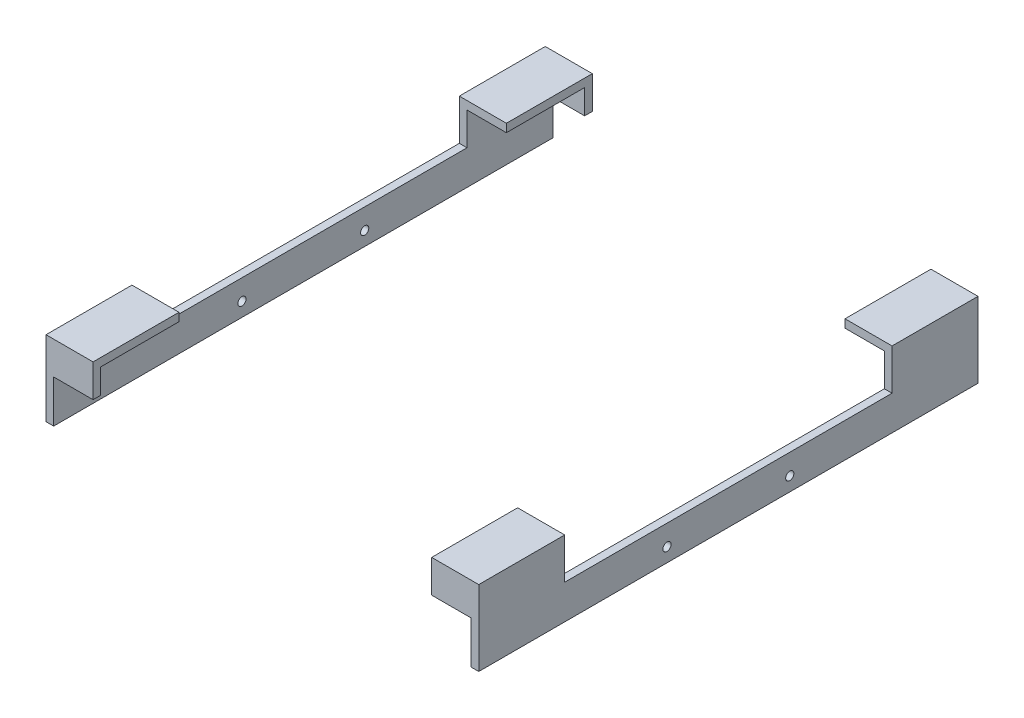
ISO-10303-21;
HEADER;
FILE_DESCRIPTION(('STEP AP214'),'2;1');
FILE_NAME('part.step','',(''),(''),'','','');
FILE_SCHEMA(('AUTOMOTIVE_DESIGN { 1 0 10303 214 1 1 1 1 }'));
ENDSEC;
DATA;
#1=APPLICATION_CONTEXT('core data for automotive mechanical design processes');
#2=APPLICATION_PROTOCOL_DEFINITION('international standard','automotive_design',2000,#1);
#3=PRODUCT_CONTEXT('',#1,'mechanical');
#4=PRODUCT('Part','Part','',(#3));
#5=PRODUCT_RELATED_PRODUCT_CATEGORY('part','',(#4));
#6=PRODUCT_DEFINITION_FORMATION('','',#4);
#7=PRODUCT_DEFINITION_CONTEXT('part definition',#1,'design');
#8=PRODUCT_DEFINITION('design','',#6,#7);
#9=PRODUCT_DEFINITION_SHAPE('','',#8);
#10=(LENGTH_UNIT() NAMED_UNIT(*) SI_UNIT(.MILLI.,.METRE.));
#11=(NAMED_UNIT(*) PLANE_ANGLE_UNIT() SI_UNIT($,.RADIAN.));
#12=(NAMED_UNIT(*) SI_UNIT($,.STERADIAN.) SOLID_ANGLE_UNIT());
#13=UNCERTAINTY_MEASURE_WITH_UNIT(LENGTH_MEASURE(1.E-05),#10,'distance_accuracy_value','');
#14=(GEOMETRIC_REPRESENTATION_CONTEXT(3) GLOBAL_UNCERTAINTY_ASSIGNED_CONTEXT((#13)) GLOBAL_UNIT_ASSIGNED_CONTEXT((#10,
#11,#12)) REPRESENTATION_CONTEXT('',''));
#15=CARTESIAN_POINT('',(0.,0.,0.));
#16=DIRECTION('',(0.,0.,1.));
#17=DIRECTION('',(1.,0.,0.));
#18=AXIS2_PLACEMENT_3D('',#15,#16,#17);
#19=CARTESIAN_POINT('',(105.0925,45.72,-154.94));
#20=DIRECTION('',(-1.,0.,0.));
#21=DIRECTION('',(0.,0.,1.));
#22=AXIS2_PLACEMENT_3D('',#19,#20,#21);
#23=PLANE('',#22);
#24=DIRECTION('',(0.,-1.,0.));
#25=VECTOR('',#24,1.);
#26=CARTESIAN_POINT('',(105.0925,50.8,101.6));
#27=LINE('',#26,#25);
#28=CARTESIAN_POINT('',(105.0925,50.8,101.6));
#29=VERTEX_POINT('',#28);
#30=CARTESIAN_POINT('',(105.0925,45.72,101.6));
#31=VERTEX_POINT('',#30);
#32=EDGE_CURVE('E295',#29,#31,#27,.T.);
#33=ORIENTED_EDGE('',*,*,#32,.T.);
#34=DIRECTION('',(0.,0.,1.));
#35=VECTOR('',#34,1.);
#36=CARTESIAN_POINT('',(105.0925,45.72,-154.94));
#37=LINE('',#36,#35);
#38=CARTESIAN_POINT('',(105.0925,45.72,150.1775));
#39=VERTEX_POINT('',#38);
#40=EDGE_CURVE('E227',#31,#39,#37,.T.);
#41=ORIENTED_EDGE('',*,*,#40,.T.);
#42=DIRECTION('',(0.,-1.,0.));
#43=VECTOR('',#42,1.);
#44=CARTESIAN_POINT('',(105.0925,50.8,150.1775));
#45=LINE('',#44,#43);
#46=CARTESIAN_POINT('',(105.0925,30.48,150.1775));
#47=VERTEX_POINT('',#46);
#48=EDGE_CURVE('E284',#39,#47,#45,.T.);
#49=ORIENTED_EDGE('',*,*,#48,.T.);
#50=DIRECTION('',(0.,0.,1.));
#51=VECTOR('',#50,1.);
#52=CARTESIAN_POINT('',(105.0925,30.48,150.1775));
#53=LINE('',#52,#51);
#54=CARTESIAN_POINT('',(105.0925,30.48,154.94));
#55=VERTEX_POINT('',#54);
#56=EDGE_CURVE('E277',#47,#55,#53,.T.);
#57=ORIENTED_EDGE('',*,*,#56,.T.);
#58=DIRECTION('',(0.,-1.,0.));
#59=VECTOR('',#58,1.);
#60=CARTESIAN_POINT('',(105.0925,45.72,154.94));
#61=LINE('',#60,#59);
#62=CARTESIAN_POINT('',(105.0925,50.8,154.94));
#63=VERTEX_POINT('',#62);
#64=EDGE_CURVE('E186',#63,#55,#61,.T.);
#65=ORIENTED_EDGE('',*,*,#64,.F.);
#66=DIRECTION('',(0.,0.,1.));
#67=VECTOR('',#66,1.);
#68=CARTESIAN_POINT('',(105.0925,50.8,-154.94));
#69=LINE('',#68,#67);
#70=EDGE_CURVE('E246',#29,#63,#69,.T.);
#71=ORIENTED_EDGE('',*,*,#70,.F.);
#72=EDGE_LOOP('',(#33,#41,#49,#57,#65,#71));
#73=FACE_BOUND('',#72,.T.);
#74=ADVANCED_FACE('F51',(#73),#23,.T.);
#75=CARTESIAN_POINT('',(0.,0.,-101.6));
#76=DIRECTION('',(0.,0.,1.));
#77=DIRECTION('',(1.,0.,0.));
#78=AXIS2_PLACEMENT_3D('',#75,#76,#77);
#79=PLANE('',#78);
#80=DIRECTION('',(0.,1.,0.));
#81=VECTOR('',#80,1.);
#82=CARTESIAN_POINT('',(129.54,0.,-101.6));
#83=LINE('',#82,#81);
#84=CARTESIAN_POINT('',(129.54,25.4,-101.6));
#85=VERTEX_POINT('',#84);
#86=CARTESIAN_POINT('',(129.54,45.72,-101.6));
#87=VERTEX_POINT('',#86);
#88=EDGE_CURVE('E206',#85,#87,#83,.T.);
#89=ORIENTED_EDGE('',*,*,#88,.F.);
#90=DIRECTION('',(1.,0.,0.));
#91=VECTOR('',#90,1.);
#92=CARTESIAN_POINT('',(105.0925,25.4,-101.6));
#93=LINE('',#92,#91);
#94=CARTESIAN_POINT('',(134.3025,25.4,-101.6));
#95=VERTEX_POINT('',#94);
#96=EDGE_CURVE('E312',#85,#95,#93,.T.);
#97=ORIENTED_EDGE('',*,*,#96,.T.);
#98=DIRECTION('',(0.,1.,0.));
#99=VECTOR('',#98,1.);
#100=CARTESIAN_POINT('',(134.3025,25.4,-101.6));
#101=LINE('',#100,#99);
#102=CARTESIAN_POINT('',(134.3025,50.8,-101.6));
#103=VERTEX_POINT('',#102);
#104=EDGE_CURVE('E335',#95,#103,#101,.T.);
#105=ORIENTED_EDGE('',*,*,#104,.T.);
#106=DIRECTION('',(-1.,0.,0.));
#107=VECTOR('',#106,1.);
#108=CARTESIAN_POINT('',(134.3025,50.8,-101.6));
#109=LINE('',#108,#107);
#110=CARTESIAN_POINT('',(105.0925,50.8,-101.6));
#111=VERTEX_POINT('',#110);
#112=EDGE_CURVE('E331',#103,#111,#109,.T.);
#113=ORIENTED_EDGE('',*,*,#112,.T.);
#114=DIRECTION('',(0.,-1.,0.));
#115=VECTOR('',#114,1.);
#116=CARTESIAN_POINT('',(105.0925,50.8,-101.6));
#117=LINE('',#116,#115);
#118=CARTESIAN_POINT('',(105.0925,45.72,-101.6));
#119=VERTEX_POINT('',#118);
#120=EDGE_CURVE('E322',#111,#119,#117,.T.);
#121=ORIENTED_EDGE('',*,*,#120,.T.);
#122=DIRECTION('',(-1.,0.,0.));
#123=VECTOR('',#122,1.);
#124=CARTESIAN_POINT('',(129.54,45.72,-101.6));
#125=LINE('',#124,#123);
#126=EDGE_CURVE('E73',#87,#119,#125,.T.);
#127=ORIENTED_EDGE('',*,*,#126,.F.);
#128=EDGE_LOOP('',(#89,#97,#105,#113,#121,#127));
#129=FACE_BOUND('',#128,.T.);
#130=ADVANCED_FACE('F326',(#129),#79,.T.);
#131=CARTESIAN_POINT('',(105.0925,50.8,-154.94));
#132=DIRECTION('',(0.,1.,0.));
#133=DIRECTION('',(-1.,0.,0.));
#134=AXIS2_PLACEMENT_3D('',#131,#132,#133);
#135=PLANE('',#134);
#136=CARTESIAN_POINT('',(105.0925,50.8,-154.94));
#137=VERTEX_POINT('',#136);
#138=EDGE_CURVE('E243',#137,#111,#69,.T.);
#139=ORIENTED_EDGE('',*,*,#138,.T.);
#140=ORIENTED_EDGE('',*,*,#112,.F.);
#141=DIRECTION('',(0.,0.,1.));
#142=VECTOR('',#141,1.);
#143=CARTESIAN_POINT('',(134.3025,50.8,-154.94));
#144=LINE('',#143,#142);
#145=CARTESIAN_POINT('',(134.3025,50.8,-154.94));
#146=VERTEX_POINT('',#145);
#147=EDGE_CURVE('E234',#146,#103,#144,.T.);
#148=ORIENTED_EDGE('',*,*,#147,.F.);
#149=DIRECTION('',(-1.,0.,0.));
#150=VECTOR('',#149,1.);
#151=CARTESIAN_POINT('',(105.0925,50.8,-154.94));
#152=LINE('',#151,#150);
#153=EDGE_CURVE('E183',#146,#137,#152,.T.);
#154=ORIENTED_EDGE('',*,*,#153,.T.);
#155=EDGE_LOOP('',(#139,#140,#148,#154));
#156=FACE_BOUND('',#155,.T.);
#157=ADVANCED_FACE('F365',(#156),#135,.T.);
#158=CARTESIAN_POINT('',(0.,0.,-154.94));
#159=DIRECTION('',(0.,0.,-1.));
#160=DIRECTION('',(-1.,0.,0.));
#161=AXIS2_PLACEMENT_3D('',#158,#159,#160);
#162=PLANE('',#161);
#163=DIRECTION('',(1.,0.,0.));
#164=VECTOR('',#163,1.);
#165=CARTESIAN_POINT('',(-134.3025,4.05032979340656,-154.94));
#166=LINE('',#165,#164);
#167=CARTESIAN_POINT('',(129.54,4.05032979340656,-154.94));
#168=VERTEX_POINT('',#167);
#169=CARTESIAN_POINT('',(134.3025,4.05032979340656,-154.94));
#170=VERTEX_POINT('',#169);
#171=EDGE_CURVE('E161',#168,#170,#166,.T.);
#172=ORIENTED_EDGE('',*,*,#171,.F.);
#173=DIRECTION('',(0.,-1.,0.));
#174=VECTOR('',#173,1.);
#175=CARTESIAN_POINT('',(129.54,0.,-154.94));
#176=LINE('',#175,#174);
#177=CARTESIAN_POINT('',(129.54,30.48,-154.94));
#178=VERTEX_POINT('',#177);
#179=EDGE_CURVE('E184',#178,#168,#176,.T.);
#180=ORIENTED_EDGE('',*,*,#179,.F.);
#181=DIRECTION('',(-1.,0.,0.));
#182=VECTOR('',#181,1.);
#183=CARTESIAN_POINT('',(105.0925,30.48,-154.94));
#184=LINE('',#183,#182);
#185=CARTESIAN_POINT('',(105.0925,30.48,-154.94));
#186=VERTEX_POINT('',#185);
#187=EDGE_CURVE('E258',#178,#186,#184,.T.);
#188=ORIENTED_EDGE('',*,*,#187,.T.);
#189=DIRECTION('',(0.,-1.,0.));
#190=VECTOR('',#189,1.);
#191=CARTESIAN_POINT('',(105.0925,45.72,-154.94));
#192=LINE('',#191,#190);
#193=EDGE_CURVE('E188',#137,#186,#192,.T.);
#194=ORIENTED_EDGE('',*,*,#193,.F.);
#195=ORIENTED_EDGE('',*,*,#153,.F.);
#196=DIRECTION('',(0.,1.,0.));
#197=VECTOR('',#196,1.);
#198=CARTESIAN_POINT('',(134.3025,50.8,-154.94));
#199=LINE('',#198,#197);
#200=EDGE_CURVE('E174',#170,#146,#199,.T.);
#201=ORIENTED_EDGE('',*,*,#200,.F.);
#202=EDGE_LOOP('',(#172,#180,#188,#194,#195,#201));
#203=FACE_BOUND('',#202,.T.);
#204=ADVANCED_FACE('F180',(#203),#162,.T.);
#205=CARTESIAN_POINT('',(105.0925,30.48,-150.1775));
#206=DIRECTION('',(0.,-1.,0.));
#207=DIRECTION('',(1.,0.,0.));
#208=AXIS2_PLACEMENT_3D('',#205,#206,#207);
#209=PLANE('',#208);
#210=ORIENTED_EDGE('',*,*,#187,.F.);
#211=DIRECTION('',(0.,0.,1.));
#212=VECTOR('',#211,1.);
#213=CARTESIAN_POINT('',(129.54,30.48,-154.94));
#214=LINE('',#213,#212);
#215=CARTESIAN_POINT('',(129.54,30.48,-150.1775));
#216=VERTEX_POINT('',#215);
#217=EDGE_CURVE('E262',#178,#216,#214,.T.);
#218=ORIENTED_EDGE('',*,*,#217,.T.);
#219=DIRECTION('',(-1.,0.,0.));
#220=VECTOR('',#219,1.);
#221=CARTESIAN_POINT('',(105.0925,30.48,-150.1775));
#222=LINE('',#221,#220);
#223=CARTESIAN_POINT('',(105.0925,30.48,-150.1775));
#224=VERTEX_POINT('',#223);
#225=EDGE_CURVE('E263',#216,#224,#222,.T.);
#226=ORIENTED_EDGE('',*,*,#225,.T.);
#227=DIRECTION('',(0.,0.,-1.));
#228=VECTOR('',#227,1.);
#229=CARTESIAN_POINT('',(105.0925,30.48,-150.1775));
#230=LINE('',#229,#228);
#231=EDGE_CURVE('E228',#224,#186,#230,.T.);
#232=ORIENTED_EDGE('',*,*,#231,.T.);
#233=EDGE_LOOP('',(#210,#218,#226,#232));
#234=FACE_BOUND('',#233,.T.);
#235=ADVANCED_FACE('F265',(#234),#209,.T.);
#236=CARTESIAN_POINT('',(129.54,45.72,-154.94));
#237=DIRECTION('',(0.,-1.,0.));
#238=DIRECTION('',(0.,0.,-1.));
#239=AXIS2_PLACEMENT_3D('',#236,#237,#238);
#240=PLANE('',#239);
#241=DIRECTION('',(0.,0.,1.));
#242=VECTOR('',#241,1.);
#243=CARTESIAN_POINT('',(129.54,45.72,-154.94));
#244=LINE('',#243,#242);
#245=CARTESIAN_POINT('',(129.54,45.72,-150.1775));
#246=VERTEX_POINT('',#245);
#247=EDGE_CURVE('E233',#246,#87,#244,.T.);
#248=ORIENTED_EDGE('',*,*,#247,.T.);
#249=ORIENTED_EDGE('',*,*,#126,.T.);
#250=CARTESIAN_POINT('',(105.0925,45.72,-150.1775));
#251=VERTEX_POINT('',#250);
#252=EDGE_CURVE('E247',#251,#119,#37,.T.);
#253=ORIENTED_EDGE('',*,*,#252,.F.);
#254=DIRECTION('',(-1.,0.,0.));
#255=VECTOR('',#254,1.);
#256=CARTESIAN_POINT('',(129.54,45.72,-150.1775));
#257=LINE('',#256,#255);
#258=EDGE_CURVE('E274',#246,#251,#257,.T.);
#259=ORIENTED_EDGE('',*,*,#258,.F.);
#260=EDGE_LOOP('',(#248,#249,#253,#259));
#261=FACE_BOUND('',#260,.T.);
#262=ADVANCED_FACE('F320',(#261),#240,.T.);
#263=CARTESIAN_POINT('',(105.0925,25.4,101.6));
#264=DIRECTION('',(0.,1.,0.));
#265=DIRECTION('',(0.,0.,1.));
#266=AXIS2_PLACEMENT_3D('',#263,#264,#265);
#267=PLANE('',#266);
#268=DIRECTION('',(1.,0.,0.));
#269=VECTOR('',#268,1.);
#270=CARTESIAN_POINT('',(105.0925,25.4,101.6));
#271=LINE('',#270,#269);
#272=CARTESIAN_POINT('',(129.54,25.4,101.6));
#273=VERTEX_POINT('',#272);
#274=CARTESIAN_POINT('',(134.3025,25.4,101.6));
#275=VERTEX_POINT('',#274);
#276=EDGE_CURVE('E218',#273,#275,#271,.T.);
#277=ORIENTED_EDGE('',*,*,#276,.T.);
#278=DIRECTION('',(0.,0.,-1.));
#279=VECTOR('',#278,1.);
#280=CARTESIAN_POINT('',(134.3025,25.4,101.6));
#281=LINE('',#280,#279);
#282=EDGE_CURVE('E317',#275,#95,#281,.T.);
#283=ORIENTED_EDGE('',*,*,#282,.T.);
#284=ORIENTED_EDGE('',*,*,#96,.F.);
#285=DIRECTION('',(0.,0.,-1.));
#286=VECTOR('',#285,1.);
#287=CARTESIAN_POINT('',(129.54,25.4,-154.94));
#288=LINE('',#287,#286);
#289=EDGE_CURVE('E208',#273,#85,#288,.T.);
#290=ORIENTED_EDGE('',*,*,#289,.F.);
#291=EDGE_LOOP('',(#277,#283,#284,#290));
#292=FACE_BOUND('',#291,.T.);
#293=ADVANCED_FACE('F328',(#292),#267,.T.);
#294=DIRECTION('',(-1.,0.,0.));
#295=VECTOR('',#294,1.);
#296=CARTESIAN_POINT('',(129.54,45.72,101.6));
#297=LINE('',#296,#295);
#298=CARTESIAN_POINT('',(129.54,45.72,101.6));
#299=VERTEX_POINT('',#298);
#300=EDGE_CURVE('E215',#299,#31,#297,.T.);
#301=ORIENTED_EDGE('',*,*,#300,.F.);
#302=CARTESIAN_POINT('',(129.54,45.72,150.1775));
#303=VERTEX_POINT('',#302);
#304=EDGE_CURVE('E225',#299,#303,#244,.T.);
#305=ORIENTED_EDGE('',*,*,#304,.T.);
#306=DIRECTION('',(-1.,0.,0.));
#307=VECTOR('',#306,1.);
#308=CARTESIAN_POINT('',(129.54,45.72,150.1775));
#309=LINE('',#308,#307);
#310=EDGE_CURVE('E240',#303,#39,#309,.T.);
#311=ORIENTED_EDGE('',*,*,#310,.T.);
#312=ORIENTED_EDGE('',*,*,#40,.F.);
#313=EDGE_LOOP('',(#301,#305,#311,#312));
#314=FACE_BOUND('',#313,.T.);
#315=ADVANCED_FACE('F223',(#314),#240,.T.);
#316=CARTESIAN_POINT('',(0.,0.,150.1775));
#317=DIRECTION('',(0.,0.,1.));
#318=DIRECTION('',(1.,0.,0.));
#319=AXIS2_PLACEMENT_3D('',#316,#317,#318);
#320=PLANE('',#319);
#321=ORIENTED_EDGE('',*,*,#310,.F.);
#322=DIRECTION('',(0.,1.,0.));
#323=VECTOR('',#322,1.);
#324=CARTESIAN_POINT('',(129.54,0.,150.1775));
#325=LINE('',#324,#323);
#326=CARTESIAN_POINT('',(129.54,30.48,150.1775));
#327=VERTEX_POINT('',#326);
#328=EDGE_CURVE('E200',#327,#303,#325,.T.);
#329=ORIENTED_EDGE('',*,*,#328,.F.);
#330=DIRECTION('',(1.,0.,0.));
#331=VECTOR('',#330,1.);
#332=CARTESIAN_POINT('',(105.0925,30.48,150.1775));
#333=LINE('',#332,#331);
#334=EDGE_CURVE('E280',#47,#327,#333,.T.);
#335=ORIENTED_EDGE('',*,*,#334,.F.);
#336=ORIENTED_EDGE('',*,*,#48,.F.);
#337=EDGE_LOOP('',(#321,#329,#335,#336));
#338=FACE_BOUND('',#337,.T.);
#339=ADVANCED_FACE('F298',(#338),#320,.F.);
#340=CARTESIAN_POINT('',(129.54,0.,-154.94));
#341=DIRECTION('',(-1.,0.,0.));
#342=DIRECTION('',(0.,0.,1.));
#343=AXIS2_PLACEMENT_3D('',#340,#341,#342);
#344=PLANE('',#343);
#345=DIRECTION('',(0.,0.,-1.));
#346=VECTOR('',#345,1.);
#347=CARTESIAN_POINT('',(129.54,4.05032979340656,-154.94));
#348=LINE('',#347,#346);
#349=CARTESIAN_POINT('',(129.54,4.05032979340656,154.94));
#350=VERTEX_POINT('',#349);
#351=EDGE_CURVE('E164',#350,#168,#348,.T.);
#352=ORIENTED_EDGE('',*,*,#351,.F.);
#353=DIRECTION('',(0.,-1.,0.));
#354=VECTOR('',#353,1.);
#355=CARTESIAN_POINT('',(129.54,0.,154.94));
#356=LINE('',#355,#354);
#357=CARTESIAN_POINT('',(129.54,30.48,154.94));
#358=VERTEX_POINT('',#357);
#359=EDGE_CURVE('E197',#358,#350,#356,.T.);
#360=ORIENTED_EDGE('',*,*,#359,.F.);
#361=DIRECTION('',(0.,0.,1.));
#362=VECTOR('',#361,1.);
#363=CARTESIAN_POINT('',(129.54,30.48,-154.94));
#364=LINE('',#363,#362);
#365=EDGE_CURVE('E283',#327,#358,#364,.T.);
#366=ORIENTED_EDGE('',*,*,#365,.F.);
#367=ORIENTED_EDGE('',*,*,#328,.T.);
#368=ORIENTED_EDGE('',*,*,#304,.F.);
#369=DIRECTION('',(0.,1.,0.));
#370=VECTOR('',#369,1.);
#371=CARTESIAN_POINT('',(129.54,0.,101.6));
#372=LINE('',#371,#370);
#373=EDGE_CURVE('E59',#273,#299,#372,.T.);
#374=ORIENTED_EDGE('',*,*,#373,.F.);
#375=ORIENTED_EDGE('',*,*,#289,.T.);
#376=ORIENTED_EDGE('',*,*,#88,.T.);
#377=ORIENTED_EDGE('',*,*,#247,.F.);
#378=DIRECTION('',(0.,1.,0.));
#379=VECTOR('',#378,1.);
#380=CARTESIAN_POINT('',(129.54,0.,-150.1775));
#381=LINE('',#380,#379);
#382=EDGE_CURVE('E203',#216,#246,#381,.T.);
#383=ORIENTED_EDGE('',*,*,#382,.F.);
#384=ORIENTED_EDGE('',*,*,#217,.F.);
#385=ORIENTED_EDGE('',*,*,#179,.T.);
#386=EDGE_LOOP('',(#352,#360,#366,#367,#368,#374,#375,#376,#377,#383,#384,#385));
#387=FACE_BOUND('',#386,.T.);
#388=CARTESIAN_POINT('',(129.54,12.7,38.1));
#389=DIRECTION('',(-1.,0.,0.));
#390=DIRECTION('',(0.,0.,1.));
#391=AXIS2_PLACEMENT_3D('',#388,#389,#390);
#392=CIRCLE('',#391,2.54);
#393=CARTESIAN_POINT('',(129.54,12.7,40.64));
#394=VERTEX_POINT('',#393);
#395=EDGE_CURVE('E337',#394,#394,#392,.T.);
#396=ORIENTED_EDGE('',*,*,#395,.F.);
#397=EDGE_LOOP('',(#396));
#398=FACE_BOUND('',#397,.T.);
#399=CARTESIAN_POINT('',(129.54,12.7,-38.1));
#400=DIRECTION('',(-1.,0.,0.));
#401=DIRECTION('',(0.,0.,1.));
#402=AXIS2_PLACEMENT_3D('',#399,#400,#401);
#403=CIRCLE('',#402,2.54);
#404=CARTESIAN_POINT('',(129.54,12.7,-35.56));
#405=VERTEX_POINT('',#404);
#406=EDGE_CURVE('E340',#405,#405,#403,.T.);
#407=ORIENTED_EDGE('',*,*,#406,.F.);
#408=EDGE_LOOP('',(#407));
#409=FACE_BOUND('',#408,.T.);
#410=ADVANCED_FACE('F230',(#387,#398,#409),#344,.T.);
#411=CARTESIAN_POINT('',(105.0925,30.48,150.1775));
#412=DIRECTION('',(0.,-1.,0.));
#413=DIRECTION('',(0.,0.,-1.));
#414=AXIS2_PLACEMENT_3D('',#411,#412,#413);
#415=PLANE('',#414);
#416=ORIENTED_EDGE('',*,*,#334,.T.);
#417=ORIENTED_EDGE('',*,*,#365,.T.);
#418=DIRECTION('',(1.,0.,0.));
#419=VECTOR('',#418,1.);
#420=CARTESIAN_POINT('',(105.0925,30.48,154.94));
#421=LINE('',#420,#419);
#422=EDGE_CURVE('E281',#55,#358,#421,.T.);
#423=ORIENTED_EDGE('',*,*,#422,.F.);
#424=ORIENTED_EDGE('',*,*,#56,.F.);
#425=EDGE_LOOP('',(#416,#417,#423,#424));
#426=FACE_BOUND('',#425,.T.);
#427=ADVANCED_FACE('F299',(#426),#415,.T.);
#428=CARTESIAN_POINT('',(134.3025,50.8,-154.94));
#429=DIRECTION('',(1.,0.,0.));
#430=DIRECTION('',(0.,0.,-1.));
#431=AXIS2_PLACEMENT_3D('',#428,#429,#430);
#432=PLANE('',#431);
#433=DIRECTION('',(0.,0.,1.));
#434=VECTOR('',#433,1.);
#435=CARTESIAN_POINT('',(134.3025,4.05032979340656,154.94));
#436=LINE('',#435,#434);
#437=CARTESIAN_POINT('',(134.3025,4.05032979340657,154.94));
#438=VERTEX_POINT('',#437);
#439=EDGE_CURVE('E66',#170,#438,#436,.T.);
#440=ORIENTED_EDGE('',*,*,#439,.F.);
#441=ORIENTED_EDGE('',*,*,#200,.T.);
#442=ORIENTED_EDGE('',*,*,#147,.T.);
#443=ORIENTED_EDGE('',*,*,#104,.F.);
#444=ORIENTED_EDGE('',*,*,#282,.F.);
#445=DIRECTION('',(0.,1.,0.));
#446=VECTOR('',#445,1.);
#447=CARTESIAN_POINT('',(134.3025,25.4,101.6));
#448=LINE('',#447,#446);
#449=CARTESIAN_POINT('',(134.3025,50.8,101.6));
#450=VERTEX_POINT('',#449);
#451=EDGE_CURVE('E309',#275,#450,#448,.T.);
#452=ORIENTED_EDGE('',*,*,#451,.T.);
#453=CARTESIAN_POINT('',(134.3025,50.8,154.94));
#454=VERTEX_POINT('',#453);
#455=EDGE_CURVE('E237',#450,#454,#144,.T.);
#456=ORIENTED_EDGE('',*,*,#455,.T.);
#457=DIRECTION('',(0.,1.,0.));
#458=VECTOR('',#457,1.);
#459=CARTESIAN_POINT('',(134.3025,50.8,154.94));
#460=LINE('',#459,#458);
#461=EDGE_CURVE('E177',#438,#454,#460,.T.);
#462=ORIENTED_EDGE('',*,*,#461,.F.);
#463=EDGE_LOOP('',(#440,#441,#442,#443,#444,#452,#456,#462));
#464=FACE_BOUND('',#463,.T.);
#465=CARTESIAN_POINT('',(134.3025,12.7,38.1));
#466=DIRECTION('',(-1.,0.,0.));
#467=DIRECTION('',(0.,0.,1.));
#468=AXIS2_PLACEMENT_3D('',#465,#466,#467);
#469=CIRCLE('',#468,2.54);
#470=CARTESIAN_POINT('',(134.3025,12.7,40.64));
#471=VERTEX_POINT('',#470);
#472=EDGE_CURVE('E343',#471,#471,#469,.T.);
#473=ORIENTED_EDGE('',*,*,#472,.T.);
#474=EDGE_LOOP('',(#473));
#475=FACE_BOUND('',#474,.T.);
#476=CARTESIAN_POINT('',(134.3025,12.7,-38.1));
#477=DIRECTION('',(-1.,0.,0.));
#478=DIRECTION('',(0.,0.,-1.));
#479=AXIS2_PLACEMENT_3D('',#476,#477,#478);
#480=CIRCLE('',#479,2.54);
#481=CARTESIAN_POINT('',(134.3025,12.7,-40.64));
#482=VERTEX_POINT('',#481);
#483=EDGE_CURVE('E344',#482,#482,#480,.T.);
#484=ORIENTED_EDGE('',*,*,#483,.T.);
#485=EDGE_LOOP('',(#484));
#486=FACE_BOUND('',#485,.T.);
#487=ADVANCED_FACE('F171',(#464,#475,#486),#432,.T.);
#488=CARTESIAN_POINT('',(0.,0.,154.94));
#489=DIRECTION('',(0.,0.,-1.));
#490=DIRECTION('',(-1.,0.,0.));
#491=AXIS2_PLACEMENT_3D('',#488,#489,#490);
#492=PLANE('',#491);
#493=ORIENTED_EDGE('',*,*,#359,.T.);
#494=DIRECTION('',(1.,0.,0.));
#495=VECTOR('',#494,1.);
#496=CARTESIAN_POINT('',(0.,4.05032979340656,154.94));
#497=LINE('',#496,#495);
#498=EDGE_CURVE('E13',#350,#438,#497,.T.);
#499=ORIENTED_EDGE('',*,*,#498,.T.);
#500=ORIENTED_EDGE('',*,*,#461,.T.);
#501=DIRECTION('',(-1.,0.,0.));
#502=VECTOR('',#501,1.);
#503=CARTESIAN_POINT('',(105.0925,50.8,154.94));
#504=LINE('',#503,#502);
#505=EDGE_CURVE('E193',#454,#63,#504,.T.);
#506=ORIENTED_EDGE('',*,*,#505,.T.);
#507=ORIENTED_EDGE('',*,*,#64,.T.);
#508=ORIENTED_EDGE('',*,*,#422,.T.);
#509=EDGE_LOOP('',(#493,#499,#500,#506,#507,#508));
#510=FACE_BOUND('',#509,.T.);
#511=ADVANCED_FACE('F53',(#510),#492,.F.);
#512=CARTESIAN_POINT('',(0.,0.,101.6));
#513=DIRECTION('',(0.,0.,1.));
#514=DIRECTION('',(1.,0.,0.));
#515=AXIS2_PLACEMENT_3D('',#512,#513,#514);
#516=PLANE('',#515);
#517=ORIENTED_EDGE('',*,*,#300,.T.);
#518=ORIENTED_EDGE('',*,*,#32,.F.);
#519=DIRECTION('',(-1.,0.,0.));
#520=VECTOR('',#519,1.);
#521=CARTESIAN_POINT('',(134.3025,50.8,101.6));
#522=LINE('',#521,#520);
#523=EDGE_CURVE('E307',#450,#29,#522,.T.);
#524=ORIENTED_EDGE('',*,*,#523,.F.);
#525=ORIENTED_EDGE('',*,*,#451,.F.);
#526=ORIENTED_EDGE('',*,*,#276,.F.);
#527=ORIENTED_EDGE('',*,*,#373,.T.);
#528=EDGE_LOOP('',(#517,#518,#524,#525,#526,#527));
#529=FACE_BOUND('',#528,.T.);
#530=ADVANCED_FACE('F214',(#529),#516,.F.);
#531=ORIENTED_EDGE('',*,*,#523,.T.);
#532=ORIENTED_EDGE('',*,*,#70,.T.);
#533=ORIENTED_EDGE('',*,*,#505,.F.);
#534=ORIENTED_EDGE('',*,*,#455,.F.);
#535=EDGE_LOOP('',(#531,#532,#533,#534));
#536=FACE_BOUND('',#535,.T.);
#537=ADVANCED_FACE('F305',(#536),#135,.T.);
#538=CARTESIAN_POINT('',(0.,0.,-150.1775));
#539=DIRECTION('',(0.,0.,1.));
#540=DIRECTION('',(1.,0.,0.));
#541=AXIS2_PLACEMENT_3D('',#538,#539,#540);
#542=PLANE('',#541);
#543=ORIENTED_EDGE('',*,*,#382,.T.);
#544=ORIENTED_EDGE('',*,*,#258,.T.);
#545=DIRECTION('',(0.,1.,0.));
#546=VECTOR('',#545,1.);
#547=CARTESIAN_POINT('',(105.0925,50.8,-150.1775));
#548=LINE('',#547,#546);
#549=EDGE_CURVE('E267',#224,#251,#548,.T.);
#550=ORIENTED_EDGE('',*,*,#549,.F.);
#551=ORIENTED_EDGE('',*,*,#225,.F.);
#552=EDGE_LOOP('',(#543,#544,#550,#551));
#553=FACE_BOUND('',#552,.T.);
#554=ADVANCED_FACE('F324',(#553),#542,.T.);
#555=ORIENTED_EDGE('',*,*,#252,.T.);
#556=ORIENTED_EDGE('',*,*,#120,.F.);
#557=ORIENTED_EDGE('',*,*,#138,.F.);
#558=ORIENTED_EDGE('',*,*,#193,.T.);
#559=ORIENTED_EDGE('',*,*,#231,.F.);
#560=ORIENTED_EDGE('',*,*,#549,.T.);
#561=EDGE_LOOP('',(#555,#556,#557,#558,#559,#560));
#562=FACE_BOUND('',#561,.T.);
#563=ADVANCED_FACE('F252',(#562),#23,.T.);
#564=CARTESIAN_POINT('',(134.3025,12.7,-38.1));
#565=DIRECTION('',(-1.,0.,0.));
#566=DIRECTION('',(0.,0.,1.));
#567=AXIS2_PLACEMENT_3D('',#564,#565,#566);
#568=CYLINDRICAL_SURFACE('',#567,2.54);
#569=ORIENTED_EDGE('',*,*,#406,.T.);
#570=EDGE_LOOP('',(#569));
#571=FACE_BOUND('',#570,.T.);
#572=ORIENTED_EDGE('',*,*,#483,.F.);
#573=EDGE_LOOP('',(#572));
#574=FACE_BOUND('',#573,.T.);
#575=ADVANCED_FACE('F354',(#571,#574),#568,.F.);
#576=CARTESIAN_POINT('',(134.3025,12.7,38.1));
#577=DIRECTION('',(-1.,0.,0.));
#578=DIRECTION('',(0.,0.,1.));
#579=AXIS2_PLACEMENT_3D('',#576,#577,#578);
#580=CYLINDRICAL_SURFACE('',#579,2.54);
#581=ORIENTED_EDGE('',*,*,#395,.T.);
#582=EDGE_LOOP('',(#581));
#583=FACE_BOUND('',#582,.T.);
#584=ORIENTED_EDGE('',*,*,#472,.F.);
#585=EDGE_LOOP('',(#584));
#586=FACE_BOUND('',#585,.T.);
#587=ADVANCED_FACE('F352',(#583,#586),#580,.F.);
#588=CARTESIAN_POINT('',(-134.3025,4.05032979340656,154.94));
#589=DIRECTION('',(0.,1.,0.));
#590=DIRECTION('',(0.,0.,1.));
#591=AXIS2_PLACEMENT_3D('',#588,#589,#590);
#592=PLANE('',#591);
#593=ORIENTED_EDGE('',*,*,#351,.T.);
#594=ORIENTED_EDGE('',*,*,#171,.T.);
#595=ORIENTED_EDGE('',*,*,#439,.T.);
#596=ORIENTED_EDGE('',*,*,#498,.F.);
#597=EDGE_LOOP('',(#593,#594,#595,#596));
#598=FACE_BOUND('',#597,.T.);
#599=ADVANCED_FACE('F162',(#598),#592,.F.);
#600=CLOSED_SHELL('',(#74,#130,#157,#204,#235,#262,#293,#315,#339,#410,#427,#487,#511,#530,#537,
#554,#563,#575,#587,#599));
#601=MANIFOLD_SOLID_BREP('B2',#600);
#602=CARTESIAN_POINT('',(-105.0925,45.72,-154.94));
#603=DIRECTION('',(1.,0.,0.));
#604=DIRECTION('',(0.,0.,-1.));
#605=AXIS2_PLACEMENT_3D('',#602,#603,#604);
#606=PLANE('',#605);
#607=DIRECTION('',(0.,1.,0.));
#608=VECTOR('',#607,1.);
#609=CARTESIAN_POINT('',(-105.0925,25.4,101.6));
#610=LINE('',#609,#608);
#611=CARTESIAN_POINT('',(-105.0925,45.72,101.6));
#612=VERTEX_POINT('',#611);
#613=CARTESIAN_POINT('',(-105.0925,50.8,101.6));
#614=VERTEX_POINT('',#613);
#615=EDGE_CURVE('E783',#612,#614,#610,.T.);
#616=ORIENTED_EDGE('',*,*,#615,.T.);
#617=DIRECTION('',(0.,0.,1.));
#618=VECTOR('',#617,1.);
#619=CARTESIAN_POINT('',(-105.0925,50.8,-154.94));
#620=LINE('',#619,#618);
#621=CARTESIAN_POINT('',(-105.0925,50.8,154.94));
#622=VERTEX_POINT('',#621);
#623=EDGE_CURVE('E739',#614,#622,#620,.T.);
#624=ORIENTED_EDGE('',*,*,#623,.T.);
#625=DIRECTION('',(0.,1.,0.));
#626=VECTOR('',#625,1.);
#627=CARTESIAN_POINT('',(-105.0925,45.72,154.94));
#628=LINE('',#627,#626);
#629=CARTESIAN_POINT('',(-105.0925,30.48,154.94));
#630=VERTEX_POINT('',#629);
#631=EDGE_CURVE('E720',#630,#622,#628,.T.);
#632=ORIENTED_EDGE('',*,*,#631,.F.);
#633=DIRECTION('',(0.,0.,1.));
#634=VECTOR('',#633,1.);
#635=CARTESIAN_POINT('',(-105.0925,30.48,150.1775));
#636=LINE('',#635,#634);
#637=CARTESIAN_POINT('',(-105.0925,30.48,150.1775));
#638=VERTEX_POINT('',#637);
#639=EDGE_CURVE('E820',#638,#630,#636,.T.);
#640=ORIENTED_EDGE('',*,*,#639,.F.);
#641=DIRECTION('',(0.,1.,0.));
#642=VECTOR('',#641,1.);
#643=CARTESIAN_POINT('',(-105.0925,30.48,150.1775));
#644=LINE('',#643,#642);
#645=CARTESIAN_POINT('',(-105.0925,45.72,150.1775));
#646=VERTEX_POINT('',#645);
#647=EDGE_CURVE('E815',#638,#646,#644,.T.);
#648=ORIENTED_EDGE('',*,*,#647,.T.);
#649=DIRECTION('',(0.,0.,1.));
#650=VECTOR('',#649,1.);
#651=CARTESIAN_POINT('',(-105.0925,45.72,-154.94));
#652=LINE('',#651,#650);
#653=EDGE_CURVE('E743',#612,#646,#652,.T.);
#654=ORIENTED_EDGE('',*,*,#653,.F.);
#655=EDGE_LOOP('',(#616,#624,#632,#640,#648,#654));
#656=FACE_BOUND('',#655,.T.);
#657=ADVANCED_FACE('F580',(#656),#606,.T.);
#658=CARTESIAN_POINT('',(0.,0.,-101.6));
#659=DIRECTION('',(0.,0.,1.));
#660=DIRECTION('',(1.,0.,0.));
#661=AXIS2_PLACEMENT_3D('',#658,#659,#660);
#662=PLANE('',#661);
#663=DIRECTION('',(0.,1.,0.));
#664=VECTOR('',#663,1.);
#665=CARTESIAN_POINT('',(-105.0925,25.4,-101.6));
#666=LINE('',#665,#664);
#667=CARTESIAN_POINT('',(-105.0925,45.72,-101.6));
#668=VERTEX_POINT('',#667);
#669=CARTESIAN_POINT('',(-105.0925,50.8,-101.6));
#670=VERTEX_POINT('',#669);
#671=EDGE_CURVE('E791',#668,#670,#666,.T.);
#672=ORIENTED_EDGE('',*,*,#671,.T.);
#673=DIRECTION('',(-1.,0.,0.));
#674=VECTOR('',#673,1.);
#675=CARTESIAN_POINT('',(-105.0925,50.8,-101.6));
#676=LINE('',#675,#674);
#677=CARTESIAN_POINT('',(-134.3025,50.8,-101.6));
#678=VERTEX_POINT('',#677);
#679=EDGE_CURVE('E789',#670,#678,#676,.T.);
#680=ORIENTED_EDGE('',*,*,#679,.T.);
#681=DIRECTION('',(0.,-1.,0.));
#682=VECTOR('',#681,1.);
#683=CARTESIAN_POINT('',(-134.3025,50.8,-101.6));
#684=LINE('',#683,#682);
#685=CARTESIAN_POINT('',(-134.3025,25.4,-101.6));
#686=VERTEX_POINT('',#685);
#687=EDGE_CURVE('E787',#678,#686,#684,.T.);
#688=ORIENTED_EDGE('',*,*,#687,.T.);
#689=DIRECTION('',(1.,0.,0.));
#690=VECTOR('',#689,1.);
#691=CARTESIAN_POINT('',(-134.3025,25.4,-101.6));
#692=LINE('',#691,#690);
#693=CARTESIAN_POINT('',(-129.54,25.4,-101.6));
#694=VERTEX_POINT('',#693);
#695=EDGE_CURVE('E605',#686,#694,#692,.T.);
#696=ORIENTED_EDGE('',*,*,#695,.T.);
#697=DIRECTION('',(0.,-1.,0.));
#698=VECTOR('',#697,1.);
#699=CARTESIAN_POINT('',(-129.54,0.,-101.6));
#700=LINE('',#699,#698);
#701=CARTESIAN_POINT('',(-129.54,45.72,-101.6));
#702=VERTEX_POINT('',#701);
#703=EDGE_CURVE('E751',#702,#694,#700,.T.);
#704=ORIENTED_EDGE('',*,*,#703,.F.);
#705=DIRECTION('',(-1.,0.,0.));
#706=VECTOR('',#705,1.);
#707=CARTESIAN_POINT('',(-129.54,45.72,-101.6));
#708=LINE('',#707,#706);
#709=EDGE_CURVE('E793',#668,#702,#708,.T.);
#710=ORIENTED_EDGE('',*,*,#709,.F.);
#711=EDGE_LOOP('',(#672,#680,#688,#696,#704,#710));
#712=FACE_BOUND('',#711,.T.);
#713=ADVANCED_FACE('F848',(#712),#662,.T.);
#714=CARTESIAN_POINT('',(-129.54,45.72,-154.94));
#715=DIRECTION('',(0.,-1.,0.));
#716=DIRECTION('',(0.,0.,-1.));
#717=AXIS2_PLACEMENT_3D('',#714,#715,#716);
#718=PLANE('',#717);
#719=CARTESIAN_POINT('',(-105.0925,45.72,-150.1775));
#720=VERTEX_POINT('',#719);
#721=EDGE_CURVE('E740',#720,#668,#652,.T.);
#722=ORIENTED_EDGE('',*,*,#721,.T.);
#723=ORIENTED_EDGE('',*,*,#709,.T.);
#724=DIRECTION('',(0.,0.,1.));
#725=VECTOR('',#724,1.);
#726=CARTESIAN_POINT('',(-129.54,45.72,-154.94));
#727=LINE('',#726,#725);
#728=CARTESIAN_POINT('',(-129.54,45.72,-150.1775));
#729=VERTEX_POINT('',#728);
#730=EDGE_CURVE('E744',#729,#702,#727,.T.);
#731=ORIENTED_EDGE('',*,*,#730,.F.);
#732=DIRECTION('',(1.,0.,0.));
#733=VECTOR('',#732,1.);
#734=CARTESIAN_POINT('',(-129.54,45.72,-150.1775));
#735=LINE('',#734,#733);
#736=EDGE_CURVE('E812',#729,#720,#735,.T.);
#737=ORIENTED_EDGE('',*,*,#736,.T.);
#738=EDGE_LOOP('',(#722,#723,#731,#737));
#739=FACE_BOUND('',#738,.T.);
#740=ADVANCED_FACE('F851',(#739),#718,.T.);
#741=CARTESIAN_POINT('',(0.,0.,-150.1775));
#742=DIRECTION('',(0.,0.,-1.));
#743=DIRECTION('',(-1.,0.,0.));
#744=AXIS2_PLACEMENT_3D('',#741,#742,#743);
#745=PLANE('',#744);
#746=ORIENTED_EDGE('',*,*,#736,.F.);
#747=DIRECTION('',(0.,1.,0.));
#748=VECTOR('',#747,1.);
#749=CARTESIAN_POINT('',(-129.54,0.,-150.1775));
#750=LINE('',#749,#748);
#751=CARTESIAN_POINT('',(-129.54,30.48,-150.1775));
#752=VERTEX_POINT('',#751);
#753=EDGE_CURVE('E749',#752,#729,#750,.T.);
#754=ORIENTED_EDGE('',*,*,#753,.F.);
#755=DIRECTION('',(-1.,0.,0.));
#756=VECTOR('',#755,1.);
#757=CARTESIAN_POINT('',(-105.0925,30.48,-150.1775));
#758=LINE('',#757,#756);
#759=CARTESIAN_POINT('',(-105.0925,30.48,-150.1775));
#760=VERTEX_POINT('',#759);
#761=EDGE_CURVE('E801',#760,#752,#758,.T.);
#762=ORIENTED_EDGE('',*,*,#761,.F.);
#763=DIRECTION('',(0.,-1.,0.));
#764=VECTOR('',#763,1.);
#765=CARTESIAN_POINT('',(-105.0925,50.8,-150.1775));
#766=LINE('',#765,#764);
#767=EDGE_CURVE('E799',#720,#760,#766,.T.);
#768=ORIENTED_EDGE('',*,*,#767,.F.);
#769=EDGE_LOOP('',(#746,#754,#762,#768));
#770=FACE_BOUND('',#769,.T.);
#771=ADVANCED_FACE('F860',(#770),#745,.F.);
#772=CARTESIAN_POINT('',(-105.0925,50.8,-154.94));
#773=DIRECTION('',(0.,1.,0.));
#774=DIRECTION('',(-1.,0.,0.));
#775=AXIS2_PLACEMENT_3D('',#772,#773,#774);
#776=PLANE('',#775);
#777=DIRECTION('',(0.,0.,1.));
#778=VECTOR('',#777,1.);
#779=CARTESIAN_POINT('',(-134.3025,50.8,-154.94));
#780=LINE('',#779,#778);
#781=CARTESIAN_POINT('',(-134.3025,50.8,-154.94));
#782=VERTEX_POINT('',#781);
#783=EDGE_CURVE('E731',#782,#678,#780,.T.);
#784=ORIENTED_EDGE('',*,*,#783,.T.);
#785=ORIENTED_EDGE('',*,*,#679,.F.);
#786=CARTESIAN_POINT('',(-105.0925,50.8,-154.94));
#787=VERTEX_POINT('',#786);
#788=EDGE_CURVE('E736',#787,#670,#620,.T.);
#789=ORIENTED_EDGE('',*,*,#788,.F.);
#790=DIRECTION('',(-1.,0.,0.));
#791=VECTOR('',#790,1.);
#792=CARTESIAN_POINT('',(-105.0925,50.8,-154.94));
#793=LINE('',#792,#791);
#794=EDGE_CURVE('E726',#787,#782,#793,.T.);
#795=ORIENTED_EDGE('',*,*,#794,.T.);
#796=EDGE_LOOP('',(#784,#785,#789,#795));
#797=FACE_BOUND('',#796,.T.);
#798=ADVANCED_FACE('F870',(#797),#776,.T.);
#799=CARTESIAN_POINT('',(-134.3025,25.4,101.6));
#800=DIRECTION('',(0.,1.,0.));
#801=DIRECTION('',(0.,0.,1.));
#802=AXIS2_PLACEMENT_3D('',#799,#800,#801);
#803=PLANE('',#802);
#804=ORIENTED_EDGE('',*,*,#695,.F.);
#805=DIRECTION('',(0.,0.,-1.));
#806=VECTOR('',#805,1.);
#807=CARTESIAN_POINT('',(-134.3025,25.4,101.6));
#808=LINE('',#807,#806);
#809=CARTESIAN_POINT('',(-134.3025,25.4,101.6));
#810=VERTEX_POINT('',#809);
#811=EDGE_CURVE('E761',#810,#686,#808,.T.);
#812=ORIENTED_EDGE('',*,*,#811,.F.);
#813=DIRECTION('',(1.,0.,0.));
#814=VECTOR('',#813,1.);
#815=CARTESIAN_POINT('',(-134.3025,25.4,101.6));
#816=LINE('',#815,#814);
#817=CARTESIAN_POINT('',(-129.54,25.4,101.6));
#818=VERTEX_POINT('',#817);
#819=EDGE_CURVE('E774',#810,#818,#816,.T.);
#820=ORIENTED_EDGE('',*,*,#819,.T.);
#821=DIRECTION('',(0.,0.,1.));
#822=VECTOR('',#821,1.);
#823=CARTESIAN_POINT('',(-129.54,25.4,-154.94));
#824=LINE('',#823,#822);
#825=EDGE_CURVE('E589',#694,#818,#824,.T.);
#826=ORIENTED_EDGE('',*,*,#825,.F.);
#827=EDGE_LOOP('',(#804,#812,#820,#826));
#828=FACE_BOUND('',#827,.T.);
#829=ADVANCED_FACE('F843',(#828),#803,.T.);
#830=CARTESIAN_POINT('',(-134.3025,50.8,-154.94));
#831=DIRECTION('',(-1.,0.,0.));
#832=DIRECTION('',(0.,0.,1.));
#833=AXIS2_PLACEMENT_3D('',#830,#831,#832);
#834=PLANE('',#833);
#835=DIRECTION('',(0.,0.,1.));
#836=VECTOR('',#835,1.);
#837=CARTESIAN_POINT('',(-134.3025,4.05032979340656,154.94));
#838=LINE('',#837,#836);
#839=CARTESIAN_POINT('',(-134.3025,4.05032979340657,-154.94));
#840=VERTEX_POINT('',#839);
#841=CARTESIAN_POINT('',(-134.3025,4.05032979340656,154.94));
#842=VERTEX_POINT('',#841);
#843=EDGE_CURVE('E597',#840,#842,#838,.T.);
#844=ORIENTED_EDGE('',*,*,#843,.T.);
#845=DIRECTION('',(0.,-1.,0.));
#846=VECTOR('',#845,1.);
#847=CARTESIAN_POINT('',(-134.3025,50.8,154.94));
#848=LINE('',#847,#846);
#849=CARTESIAN_POINT('',(-134.3025,50.8,154.94));
#850=VERTEX_POINT('',#849);
#851=EDGE_CURVE('E707',#850,#842,#848,.T.);
#852=ORIENTED_EDGE('',*,*,#851,.F.);
#853=CARTESIAN_POINT('',(-134.3025,50.8,101.6));
#854=VERTEX_POINT('',#853);
#855=EDGE_CURVE('E735',#854,#850,#780,.T.);
#856=ORIENTED_EDGE('',*,*,#855,.F.);
#857=DIRECTION('',(0.,-1.,0.));
#858=VECTOR('',#857,1.);
#859=CARTESIAN_POINT('',(-134.3025,50.8,101.6));
#860=LINE('',#859,#858);
#861=EDGE_CURVE('E777',#854,#810,#860,.T.);
#862=ORIENTED_EDGE('',*,*,#861,.T.);
#863=ORIENTED_EDGE('',*,*,#811,.T.);
#864=ORIENTED_EDGE('',*,*,#687,.F.);
#865=ORIENTED_EDGE('',*,*,#783,.F.);
#866=DIRECTION('',(0.,-1.,0.));
#867=VECTOR('',#866,1.);
#868=CARTESIAN_POINT('',(-134.3025,50.8,-154.94));
#869=LINE('',#868,#867);
#870=EDGE_CURVE('E709',#782,#840,#869,.T.);
#871=ORIENTED_EDGE('',*,*,#870,.T.);
#872=EDGE_LOOP('',(#844,#852,#856,#862,#863,#864,#865,#871));
#873=FACE_BOUND('',#872,.T.);
#874=CARTESIAN_POINT('',(-134.3025,12.7,38.1));
#875=DIRECTION('',(-1.,0.,0.));
#876=DIRECTION('',(0.,0.,1.));
#877=AXIS2_PLACEMENT_3D('',#874,#875,#876);
#878=CIRCLE('',#877,2.54);
#879=CARTESIAN_POINT('',(-134.3025,12.7,40.64));
#880=VERTEX_POINT('',#879);
#881=EDGE_CURVE('E757',#880,#880,#878,.T.);
#882=ORIENTED_EDGE('',*,*,#881,.F.);
#883=EDGE_LOOP('',(#882));
#884=FACE_BOUND('',#883,.T.);
#885=CARTESIAN_POINT('',(-134.3025,12.7,-38.1));
#886=DIRECTION('',(-1.,0.,0.));
#887=DIRECTION('',(0.,0.,-1.));
#888=AXIS2_PLACEMENT_3D('',#885,#886,#887);
#889=CIRCLE('',#888,2.54);
#890=CARTESIAN_POINT('',(-134.3025,12.7,-40.64));
#891=VERTEX_POINT('',#890);
#892=EDGE_CURVE('E763',#891,#891,#889,.T.);
#893=ORIENTED_EDGE('',*,*,#892,.F.);
#894=EDGE_LOOP('',(#893));
#895=FACE_BOUND('',#894,.T.);
#896=ADVANCED_FACE('F704',(#873,#884,#895),#834,.T.);
#897=DIRECTION('',(-1.,0.,0.));
#898=VECTOR('',#897,1.);
#899=CARTESIAN_POINT('',(-105.0925,50.8,101.6));
#900=LINE('',#899,#898);
#901=EDGE_CURVE('E780',#614,#854,#900,.T.);
#902=ORIENTED_EDGE('',*,*,#901,.T.);
#903=ORIENTED_EDGE('',*,*,#855,.T.);
#904=DIRECTION('',(-1.,0.,0.));
#905=VECTOR('',#904,1.);
#906=CARTESIAN_POINT('',(-105.0925,50.8,154.94));
#907=LINE('',#906,#905);
#908=EDGE_CURVE('E715',#622,#850,#907,.T.);
#909=ORIENTED_EDGE('',*,*,#908,.F.);
#910=ORIENTED_EDGE('',*,*,#623,.F.);
#911=EDGE_LOOP('',(#902,#903,#909,#910));
#912=FACE_BOUND('',#911,.T.);
#913=ADVANCED_FACE('F836',(#912),#776,.T.);
#914=CARTESIAN_POINT('',(0.,0.,154.94));
#915=DIRECTION('',(0.,0.,1.));
#916=DIRECTION('',(1.,0.,0.));
#917=AXIS2_PLACEMENT_3D('',#914,#915,#916);
#918=PLANE('',#917);
#919=DIRECTION('',(1.,0.,0.));
#920=VECTOR('',#919,1.);
#921=CARTESIAN_POINT('',(-134.3025,4.05032979340656,154.94));
#922=LINE('',#921,#920);
#923=CARTESIAN_POINT('',(-129.54,4.05032979340656,154.94));
#924=VERTEX_POINT('',#923);
#925=EDGE_CURVE('E692',#842,#924,#922,.T.);
#926=ORIENTED_EDGE('',*,*,#925,.T.);
#927=DIRECTION('',(0.,1.,0.));
#928=VECTOR('',#927,1.);
#929=CARTESIAN_POINT('',(-129.54,0.,154.94));
#930=LINE('',#929,#928);
#931=CARTESIAN_POINT('',(-129.54,30.48,154.94));
#932=VERTEX_POINT('',#931);
#933=EDGE_CURVE('E830',#924,#932,#930,.T.);
#934=ORIENTED_EDGE('',*,*,#933,.T.);
#935=DIRECTION('',(1.,0.,0.));
#936=VECTOR('',#935,1.);
#937=CARTESIAN_POINT('',(-134.3025,30.48,154.94));
#938=LINE('',#937,#936);
#939=EDGE_CURVE('E814',#932,#630,#938,.T.);
#940=ORIENTED_EDGE('',*,*,#939,.T.);
#941=ORIENTED_EDGE('',*,*,#631,.T.);
#942=ORIENTED_EDGE('',*,*,#908,.T.);
#943=ORIENTED_EDGE('',*,*,#851,.T.);
#944=EDGE_LOOP('',(#926,#934,#940,#941,#942,#943));
#945=FACE_BOUND('',#944,.T.);
#946=ADVANCED_FACE('F712',(#945),#918,.T.);
#947=CARTESIAN_POINT('',(-134.3025,30.48,150.1775));
#948=DIRECTION('',(0.,-1.,0.));
#949=DIRECTION('',(0.,0.,-1.));
#950=AXIS2_PLACEMENT_3D('',#947,#948,#949);
#951=PLANE('',#950);
#952=ORIENTED_EDGE('',*,*,#939,.F.);
#953=DIRECTION('',(0.,0.,-1.));
#954=VECTOR('',#953,1.);
#955=CARTESIAN_POINT('',(-129.54,30.48,-154.94));
#956=LINE('',#955,#954);
#957=CARTESIAN_POINT('',(-129.54,30.48,150.1775));
#958=VERTEX_POINT('',#957);
#959=EDGE_CURVE('E825',#932,#958,#956,.T.);
#960=ORIENTED_EDGE('',*,*,#959,.T.);
#961=DIRECTION('',(1.,0.,0.));
#962=VECTOR('',#961,1.);
#963=CARTESIAN_POINT('',(-134.3025,30.48,150.1775));
#964=LINE('',#963,#962);
#965=EDGE_CURVE('E818',#958,#638,#964,.T.);
#966=ORIENTED_EDGE('',*,*,#965,.T.);
#967=ORIENTED_EDGE('',*,*,#639,.T.);
#968=EDGE_LOOP('',(#952,#960,#966,#967));
#969=FACE_BOUND('',#968,.T.);
#970=ADVANCED_FACE('F898',(#969),#951,.T.);
#971=CARTESIAN_POINT('',(-129.54,0.,-154.94));
#972=DIRECTION('',(1.,0.,0.));
#973=DIRECTION('',(0.,0.,-1.));
#974=AXIS2_PLACEMENT_3D('',#971,#972,#973);
#975=PLANE('',#974);
#976=DIRECTION('',(0.,0.,1.));
#977=VECTOR('',#976,1.);
#978=CARTESIAN_POINT('',(-129.54,4.05032979340656,-154.94));
#979=LINE('',#978,#977);
#980=CARTESIAN_POINT('',(-129.54,4.05032979340656,-154.94));
#981=VERTEX_POINT('',#980);
#982=EDGE_CURVE('E695',#981,#924,#979,.T.);
#983=ORIENTED_EDGE('',*,*,#982,.F.);
#984=DIRECTION('',(0.,1.,0.));
#985=VECTOR('',#984,1.);
#986=CARTESIAN_POINT('',(-129.54,0.,-154.94));
#987=LINE('',#986,#985);
#988=CARTESIAN_POINT('',(-129.54,30.48,-154.94));
#989=VERTEX_POINT('',#988);
#990=EDGE_CURVE('E716',#981,#989,#987,.T.);
#991=ORIENTED_EDGE('',*,*,#990,.T.);
#992=DIRECTION('',(0.,0.,-1.));
#993=VECTOR('',#992,1.);
#994=CARTESIAN_POINT('',(-129.54,30.48,-154.94));
#995=LINE('',#994,#993);
#996=EDGE_CURVE('E809',#752,#989,#995,.T.);
#997=ORIENTED_EDGE('',*,*,#996,.F.);
#998=ORIENTED_EDGE('',*,*,#753,.T.);
#999=ORIENTED_EDGE('',*,*,#730,.T.);
#1000=ORIENTED_EDGE('',*,*,#703,.T.);
#1001=ORIENTED_EDGE('',*,*,#825,.T.);
#1002=DIRECTION('',(0.,-1.,0.));
#1003=VECTOR('',#1002,1.);
#1004=CARTESIAN_POINT('',(-129.54,0.,101.6));
#1005=LINE('',#1004,#1003);
#1006=CARTESIAN_POINT('',(-129.54,45.72,101.6));
#1007=VERTEX_POINT('',#1006);
#1008=EDGE_CURVE('E49',#1007,#818,#1005,.T.);
#1009=ORIENTED_EDGE('',*,*,#1008,.F.);
#1010=CARTESIAN_POINT('',(-129.54,45.72,150.1775));
#1011=VERTEX_POINT('',#1010);
#1012=EDGE_CURVE('E730',#1007,#1011,#727,.T.);
#1013=ORIENTED_EDGE('',*,*,#1012,.T.);
#1014=DIRECTION('',(0.,-1.,0.));
#1015=VECTOR('',#1014,1.);
#1016=CARTESIAN_POINT('',(-129.54,0.,150.1775));
#1017=LINE('',#1016,#1015);
#1018=EDGE_CURVE('E734',#1011,#958,#1017,.T.);
#1019=ORIENTED_EDGE('',*,*,#1018,.T.);
#1020=ORIENTED_EDGE('',*,*,#959,.F.);
#1021=ORIENTED_EDGE('',*,*,#933,.F.);
#1022=EDGE_LOOP('',(#983,#991,#997,#998,#999,#1000,#1001,#1009,#1013,#1019,#1020,#1021));
#1023=FACE_BOUND('',#1022,.T.);
#1024=CARTESIAN_POINT('',(-129.54,12.7,38.1));
#1025=DIRECTION('',(1.,0.,0.));
#1026=DIRECTION('',(0.,0.,-1.));
#1027=AXIS2_PLACEMENT_3D('',#1024,#1025,#1026);
#1028=CIRCLE('',#1027,2.54);
#1029=CARTESIAN_POINT('',(-129.54,12.7,35.56));
#1030=VERTEX_POINT('',#1029);
#1031=EDGE_CURVE('E584',#1030,#1030,#1028,.T.);
#1032=ORIENTED_EDGE('',*,*,#1031,.F.);
#1033=EDGE_LOOP('',(#1032));
#1034=FACE_BOUND('',#1033,.T.);
#1035=CARTESIAN_POINT('',(-129.54,12.7,-38.1));
#1036=DIRECTION('',(1.,0.,0.));
#1037=DIRECTION('',(0.,0.,-1.));
#1038=AXIS2_PLACEMENT_3D('',#1035,#1036,#1037);
#1039=CIRCLE('',#1038,2.54);
#1040=CARTESIAN_POINT('',(-129.54,12.7,-40.64));
#1041=VERTEX_POINT('',#1040);
#1042=EDGE_CURVE('E755',#1041,#1041,#1039,.T.);
#1043=ORIENTED_EDGE('',*,*,#1042,.F.);
#1044=EDGE_LOOP('',(#1043));
#1045=FACE_BOUND('',#1044,.T.);
#1046=ADVANCED_FACE('F582',(#1023,#1034,#1045),#975,.T.);
#1047=CARTESIAN_POINT('',(0.,0.,150.1775));
#1048=DIRECTION('',(0.,0.,1.));
#1049=DIRECTION('',(1.,0.,0.));
#1050=AXIS2_PLACEMENT_3D('',#1047,#1048,#1049);
#1051=PLANE('',#1050);
#1052=DIRECTION('',(-1.,0.,0.));
#1053=VECTOR('',#1052,1.);
#1054=CARTESIAN_POINT('',(-129.54,45.72,150.1775));
#1055=LINE('',#1054,#1053);
#1056=EDGE_CURVE('E827',#646,#1011,#1055,.T.);
#1057=ORIENTED_EDGE('',*,*,#1056,.F.);
#1058=ORIENTED_EDGE('',*,*,#647,.F.);
#1059=ORIENTED_EDGE('',*,*,#965,.F.);
#1060=ORIENTED_EDGE('',*,*,#1018,.F.);
#1061=EDGE_LOOP('',(#1057,#1058,#1059,#1060));
#1062=FACE_BOUND('',#1061,.T.);
#1063=ADVANCED_FACE('F894',(#1062),#1051,.F.);
#1064=CARTESIAN_POINT('',(0.,0.,101.6));
#1065=DIRECTION('',(0.,0.,1.));
#1066=DIRECTION('',(1.,0.,0.));
#1067=AXIS2_PLACEMENT_3D('',#1064,#1065,#1066);
#1068=PLANE('',#1067);
#1069=DIRECTION('',(-1.,0.,0.));
#1070=VECTOR('',#1069,1.);
#1071=CARTESIAN_POINT('',(-129.54,45.72,101.6));
#1072=LINE('',#1071,#1070);
#1073=EDGE_CURVE('E796',#612,#1007,#1072,.T.);
#1074=ORIENTED_EDGE('',*,*,#1073,.T.);
#1075=ORIENTED_EDGE('',*,*,#1008,.T.);
#1076=ORIENTED_EDGE('',*,*,#819,.F.);
#1077=ORIENTED_EDGE('',*,*,#861,.F.);
#1078=ORIENTED_EDGE('',*,*,#901,.F.);
#1079=ORIENTED_EDGE('',*,*,#615,.F.);
#1080=EDGE_LOOP('',(#1074,#1075,#1076,#1077,#1078,#1079));
#1081=FACE_BOUND('',#1080,.T.);
#1082=ADVANCED_FACE('F840',(#1081),#1068,.F.);
#1083=ORIENTED_EDGE('',*,*,#1073,.F.);
#1084=ORIENTED_EDGE('',*,*,#653,.T.);
#1085=ORIENTED_EDGE('',*,*,#1056,.T.);
#1086=ORIENTED_EDGE('',*,*,#1012,.F.);
#1087=EDGE_LOOP('',(#1083,#1084,#1085,#1086));
#1088=FACE_BOUND('',#1087,.T.);
#1089=ADVANCED_FACE('F889',(#1088),#718,.T.);
#1090=CARTESIAN_POINT('',(-105.0925,30.48,-150.1775));
#1091=DIRECTION('',(0.,-1.,0.));
#1092=DIRECTION('',(0.,0.,-1.));
#1093=AXIS2_PLACEMENT_3D('',#1090,#1091,#1092);
#1094=PLANE('',#1093);
#1095=ORIENTED_EDGE('',*,*,#761,.T.);
#1096=ORIENTED_EDGE('',*,*,#996,.T.);
#1097=DIRECTION('',(-1.,0.,0.));
#1098=VECTOR('',#1097,1.);
#1099=CARTESIAN_POINT('',(-105.0925,30.48,-154.94));
#1100=LINE('',#1099,#1098);
#1101=CARTESIAN_POINT('',(-105.0925,30.48,-154.94));
#1102=VERTEX_POINT('',#1101);
#1103=EDGE_CURVE('E798',#1102,#989,#1100,.T.);
#1104=ORIENTED_EDGE('',*,*,#1103,.F.);
#1105=DIRECTION('',(0.,0.,-1.));
#1106=VECTOR('',#1105,1.);
#1107=CARTESIAN_POINT('',(-105.0925,30.48,-150.1775));
#1108=LINE('',#1107,#1106);
#1109=EDGE_CURVE('E804',#760,#1102,#1108,.T.);
#1110=ORIENTED_EDGE('',*,*,#1109,.F.);
#1111=EDGE_LOOP('',(#1095,#1096,#1104,#1110));
#1112=FACE_BOUND('',#1111,.T.);
#1113=ADVANCED_FACE('F863',(#1112),#1094,.T.);
#1114=CARTESIAN_POINT('',(0.,0.,-154.94));
#1115=DIRECTION('',(0.,0.,1.));
#1116=DIRECTION('',(1.,0.,0.));
#1117=AXIS2_PLACEMENT_3D('',#1114,#1115,#1116);
#1118=PLANE('',#1117);
#1119=ORIENTED_EDGE('',*,*,#990,.F.);
#1120=DIRECTION('',(1.,0.,0.));
#1121=VECTOR('',#1120,1.);
#1122=CARTESIAN_POINT('',(-134.3025,4.05032979340656,-154.94));
#1123=LINE('',#1122,#1121);
#1124=EDGE_CURVE('E699',#840,#981,#1123,.T.);
#1125=ORIENTED_EDGE('',*,*,#1124,.F.);
#1126=ORIENTED_EDGE('',*,*,#870,.F.);
#1127=ORIENTED_EDGE('',*,*,#794,.F.);
#1128=DIRECTION('',(0.,1.,0.));
#1129=VECTOR('',#1128,1.);
#1130=CARTESIAN_POINT('',(-105.0925,45.72,-154.94));
#1131=LINE('',#1130,#1129);
#1132=EDGE_CURVE('E718',#1102,#787,#1131,.T.);
#1133=ORIENTED_EDGE('',*,*,#1132,.F.);
#1134=ORIENTED_EDGE('',*,*,#1103,.T.);
#1135=EDGE_LOOP('',(#1119,#1125,#1126,#1127,#1133,#1134));
#1136=FACE_BOUND('',#1135,.T.);
#1137=ADVANCED_FACE('F868',(#1136),#1118,.F.);
#1138=ORIENTED_EDGE('',*,*,#788,.T.);
#1139=ORIENTED_EDGE('',*,*,#671,.F.);
#1140=ORIENTED_EDGE('',*,*,#721,.F.);
#1141=ORIENTED_EDGE('',*,*,#767,.T.);
#1142=ORIENTED_EDGE('',*,*,#1109,.T.);
#1143=ORIENTED_EDGE('',*,*,#1132,.T.);
#1144=EDGE_LOOP('',(#1138,#1139,#1140,#1141,#1142,#1143));
#1145=FACE_BOUND('',#1144,.T.);
#1146=ADVANCED_FACE('F856',(#1145),#606,.T.);
#1147=CARTESIAN_POINT('',(134.3025,12.7,-38.1));
#1148=DIRECTION('',(-1.,0.,0.));
#1149=DIRECTION('',(0.,0.,1.));
#1150=AXIS2_PLACEMENT_3D('',#1147,#1148,#1149);
#1151=CYLINDRICAL_SURFACE('',#1150,2.54);
#1152=ORIENTED_EDGE('',*,*,#1042,.T.);
#1153=EDGE_LOOP('',(#1152));
#1154=FACE_BOUND('',#1153,.T.);
#1155=ORIENTED_EDGE('',*,*,#892,.T.);
#1156=EDGE_LOOP('',(#1155));
#1157=FACE_BOUND('',#1156,.T.);
#1158=ADVANCED_FACE('F958',(#1154,#1157),#1151,.F.);
#1159=CARTESIAN_POINT('',(134.3025,12.7,38.1));
#1160=DIRECTION('',(-1.,0.,0.));
#1161=DIRECTION('',(0.,0.,1.));
#1162=AXIS2_PLACEMENT_3D('',#1159,#1160,#1161);
#1163=CYLINDRICAL_SURFACE('',#1162,2.54);
#1164=ORIENTED_EDGE('',*,*,#1031,.T.);
#1165=EDGE_LOOP('',(#1164));
#1166=FACE_BOUND('',#1165,.T.);
#1167=ORIENTED_EDGE('',*,*,#881,.T.);
#1168=EDGE_LOOP('',(#1167));
#1169=FACE_BOUND('',#1168,.T.);
#1170=ADVANCED_FACE('F964',(#1166,#1169),#1163,.F.);
#1171=CARTESIAN_POINT('',(-134.3025,4.05032979340656,154.94));
#1172=DIRECTION('',(0.,1.,0.));
#1173=DIRECTION('',(0.,0.,1.));
#1174=AXIS2_PLACEMENT_3D('',#1171,#1172,#1173);
#1175=PLANE('',#1174);
#1176=ORIENTED_EDGE('',*,*,#982,.T.);
#1177=ORIENTED_EDGE('',*,*,#925,.F.);
#1178=ORIENTED_EDGE('',*,*,#843,.F.);
#1179=ORIENTED_EDGE('',*,*,#1124,.T.);
#1180=EDGE_LOOP('',(#1176,#1177,#1178,#1179));
#1181=FACE_BOUND('',#1180,.T.);
#1182=ADVANCED_FACE('F693',(#1181),#1175,.F.);
#1183=CLOSED_SHELL('',(#657,#713,#740,#771,#798,#829,#896,#913,#946,#970,#1046,#1063,#1082,
#1089,#1113,#1137,#1146,#1158,#1170,#1182));
#1184=MANIFOLD_SOLID_BREP('B7',#1183);
#1185=ADVANCED_BREP_SHAPE_REPRESENTATION('',(#18,#601,#1184),#14);
#1186=SHAPE_DEFINITION_REPRESENTATION(#9,#1185);
ENDSEC;
END-ISO-10303-21;
